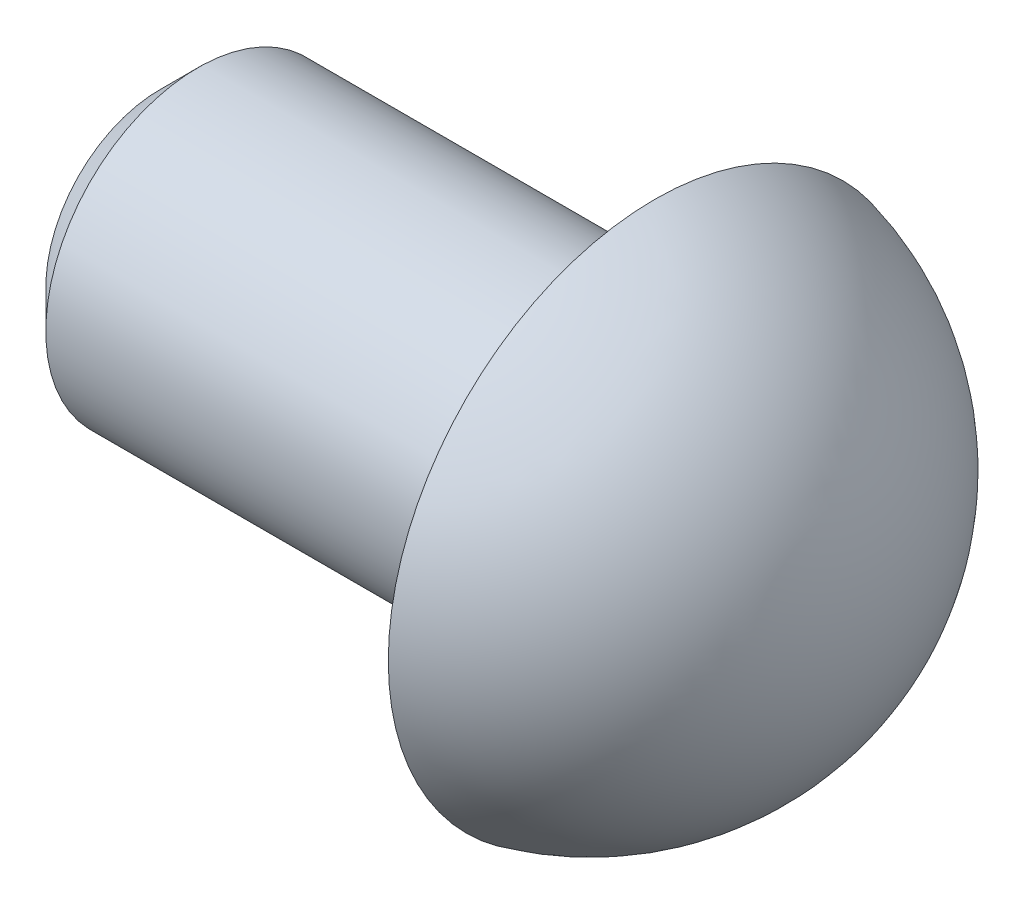
ISO-10303-21;
HEADER;
FILE_DESCRIPTION(('STEP AP214'),'2;1');
FILE_NAME('part.step','',(''),(''),'','','');
FILE_SCHEMA(('AUTOMOTIVE_DESIGN { 1 0 10303 214 1 1 1 1 }'));
ENDSEC;
DATA;
#1=APPLICATION_CONTEXT('core data for automotive mechanical design processes');
#2=APPLICATION_PROTOCOL_DEFINITION('international standard','automotive_design',2000,#1);
#3=PRODUCT_CONTEXT('',#1,'mechanical');
#4=PRODUCT('Part','Part','',(#3));
#5=PRODUCT_RELATED_PRODUCT_CATEGORY('part','',(#4));
#6=PRODUCT_DEFINITION_FORMATION('','',#4);
#7=PRODUCT_DEFINITION_CONTEXT('part definition',#1,'design');
#8=PRODUCT_DEFINITION('design','',#6,#7);
#9=PRODUCT_DEFINITION_SHAPE('','',#8);
#10=(LENGTH_UNIT() NAMED_UNIT(*) SI_UNIT(.MILLI.,.METRE.));
#11=(NAMED_UNIT(*) PLANE_ANGLE_UNIT() SI_UNIT($,.RADIAN.));
#12=(NAMED_UNIT(*) SI_UNIT($,.STERADIAN.) SOLID_ANGLE_UNIT());
#13=UNCERTAINTY_MEASURE_WITH_UNIT(LENGTH_MEASURE(1.E-05),#10,'distance_accuracy_value','');
#14=(GEOMETRIC_REPRESENTATION_CONTEXT(3) GLOBAL_UNCERTAINTY_ASSIGNED_CONTEXT((#13)) GLOBAL_UNIT_ASSIGNED_CONTEXT((#10,
#11,#12)) REPRESENTATION_CONTEXT('',''));
#15=CARTESIAN_POINT('',(0.,0.,0.));
#16=DIRECTION('',(0.,0.,1.));
#17=DIRECTION('',(1.,0.,0.));
#18=AXIS2_PLACEMENT_3D('',#15,#16,#17);
#19=CARTESIAN_POINT('',(-6.5,0.,0.));
#20=DIRECTION('',(1.,0.,0.));
#21=DIRECTION('',(0.,0.,-1.));
#22=AXIS2_PLACEMENT_3D('',#19,#20,#21);
#23=CYLINDRICAL_SURFACE('',#22,2.);
#24=CARTESIAN_POINT('',(-6.,0.,0.));
#25=DIRECTION('',(1.,0.,0.));
#26=DIRECTION('',(0.,0.,-1.));
#27=AXIS2_PLACEMENT_3D('',#24,#25,#26);
#28=CIRCLE('',#27,2.);
#29=CARTESIAN_POINT('',(-6.,0.,-2.));
#30=VERTEX_POINT('',#29);
#31=EDGE_CURVE('E39',#30,#30,#28,.T.);
#32=ORIENTED_EDGE('',*,*,#31,.T.);
#33=EDGE_LOOP('',(#32));
#34=FACE_BOUND('',#33,.T.);
#35=CARTESIAN_POINT('',(0.,0.,0.));
#36=DIRECTION('',(1.,0.,0.));
#37=DIRECTION('',(0.,0.,-1.));
#38=AXIS2_PLACEMENT_3D('',#35,#36,#37);
#39=CIRCLE('',#38,2.);
#40=CARTESIAN_POINT('',(0.,0.,-2.));
#41=VERTEX_POINT('',#40);
#42=EDGE_CURVE('E43',#41,#41,#39,.T.);
#43=ORIENTED_EDGE('',*,*,#42,.F.);
#44=EDGE_LOOP('',(#43));
#45=FACE_BOUND('',#44,.T.);
#46=ADVANCED_FACE('F32',(#34,#45),#23,.T.);
#47=CARTESIAN_POINT('',(-6.5,0.,0.));
#48=DIRECTION('',(1.,0.,0.));
#49=DIRECTION('',(0.,0.,-1.));
#50=AXIS2_PLACEMENT_3D('',#47,#48,#49);
#51=PLANE('',#50);
#52=CARTESIAN_POINT('',(-6.5,0.,0.));
#53=DIRECTION('',(1.,0.,0.));
#54=DIRECTION('',(0.,0.,-1.));
#55=AXIS2_PLACEMENT_3D('',#52,#53,#54);
#56=CIRCLE('',#55,1.49999999999999);
#57=CARTESIAN_POINT('',(-6.5,0.,-1.49999999999999));
#58=VERTEX_POINT('',#57);
#59=EDGE_CURVE('E10',#58,#58,#56,.F.);
#60=ORIENTED_EDGE('',*,*,#59,.T.);
#61=EDGE_LOOP('',(#60));
#62=FACE_BOUND('',#61,.T.);
#63=ADVANCED_FACE('F57',(#62),#51,.F.);
#64=CARTESIAN_POINT('',(-0.842614977317635,0.,0.));
#65=DIRECTION('',(-1.,0.,0.));
#66=DIRECTION('',(0.,0.,-1.));
#67=AXIS2_PLACEMENT_3D('',#64,#65,#66);
#68=SPHERICAL_SURFACE('',#67,3.6);
#69=CARTESIAN_POINT('',(0.,0.,0.));
#70=DIRECTION('',(-1.,0.,0.));
#71=DIRECTION('',(0.,0.,1.));
#72=AXIS2_PLACEMENT_3D('',#69,#70,#71);
#73=CIRCLE('',#72,3.5);
#74=CARTESIAN_POINT('',(0.,0.,3.5));
#75=VERTEX_POINT('',#74);
#76=EDGE_CURVE('E47',#75,#75,#73,.T.);
#77=ORIENTED_EDGE('',*,*,#76,.F.);
#78=EDGE_LOOP('',(#77));
#79=FACE_BOUND('',#78,.T.);
#80=ADVANCED_FACE('F55',(#79),#68,.T.);
#81=CARTESIAN_POINT('',(0.,0.,0.));
#82=DIRECTION('',(1.,0.,0.));
#83=DIRECTION('',(0.,0.,-1.));
#84=AXIS2_PLACEMENT_3D('',#81,#82,#83);
#85=PLANE('',#84);
#86=ORIENTED_EDGE('',*,*,#42,.T.);
#87=EDGE_LOOP('',(#86));
#88=FACE_BOUND('',#87,.T.);
#89=ORIENTED_EDGE('',*,*,#76,.T.);
#90=EDGE_LOOP('',(#89));
#91=FACE_BOUND('',#90,.T.);
#92=ADVANCED_FACE('F53',(#88,#91),#85,.F.);
#93=CARTESIAN_POINT('',(-6.,0.,0.));
#94=DIRECTION('',(1.,0.,0.));
#95=DIRECTION('',(0.,0.,-1.));
#96=AXIS2_PLACEMENT_3D('',#93,#94,#95);
#97=CONICAL_SURFACE('',#96,2.,0.78539816339745);
#98=ORIENTED_EDGE('',*,*,#59,.F.);
#99=EDGE_LOOP('',(#98));
#100=FACE_BOUND('',#99,.T.);
#101=ORIENTED_EDGE('',*,*,#31,.F.);
#102=EDGE_LOOP('',(#101));
#103=FACE_BOUND('',#102,.T.);
#104=ADVANCED_FACE('F34',(#100,#103),#97,.T.);
#105=CLOSED_SHELL('',(#46,#63,#80,#92,#104));
#106=MANIFOLD_SOLID_BREP('B2',#105);
#107=ADVANCED_BREP_SHAPE_REPRESENTATION('',(#18,#106),#14);
#108=SHAPE_DEFINITION_REPRESENTATION(#9,#107);
ENDSEC;
END-ISO-10303-21;
